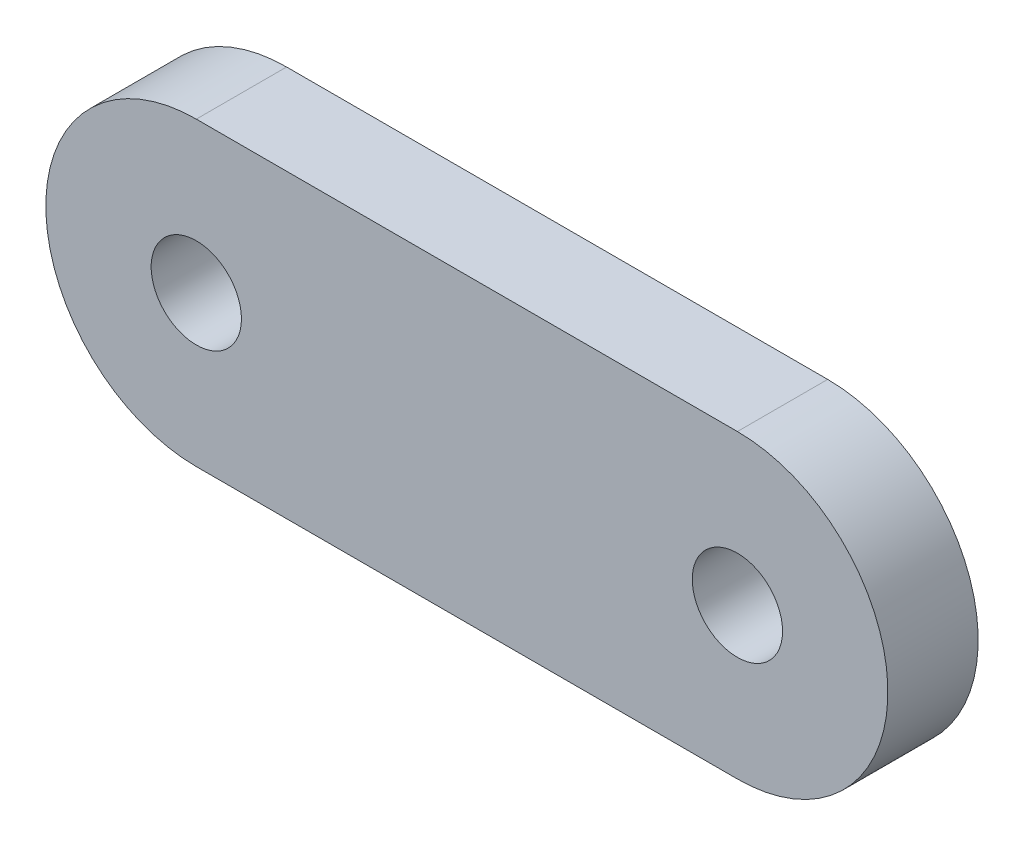
ISO-10303-21;
HEADER;
FILE_DESCRIPTION(('STEP AP214'),'2;1');
FILE_NAME('part.step','',(''),(''),'','','');
FILE_SCHEMA(('AUTOMOTIVE_DESIGN { 1 0 10303 214 1 1 1 1 }'));
ENDSEC;
DATA;
#1=APPLICATION_CONTEXT('core data for automotive mechanical design processes');
#2=APPLICATION_PROTOCOL_DEFINITION('international standard','automotive_design',2000,#1);
#3=PRODUCT_CONTEXT('',#1,'mechanical');
#4=PRODUCT('Part','Part','',(#3));
#5=PRODUCT_RELATED_PRODUCT_CATEGORY('part','',(#4));
#6=PRODUCT_DEFINITION_FORMATION('','',#4);
#7=PRODUCT_DEFINITION_CONTEXT('part definition',#1,'design');
#8=PRODUCT_DEFINITION('design','',#6,#7);
#9=PRODUCT_DEFINITION_SHAPE('','',#8);
#10=(LENGTH_UNIT() NAMED_UNIT(*) SI_UNIT(.MILLI.,.METRE.));
#11=(NAMED_UNIT(*) PLANE_ANGLE_UNIT() SI_UNIT($,.RADIAN.));
#12=(NAMED_UNIT(*) SI_UNIT($,.STERADIAN.) SOLID_ANGLE_UNIT());
#13=UNCERTAINTY_MEASURE_WITH_UNIT(LENGTH_MEASURE(1.E-05),#10,'distance_accuracy_value','');
#14=(GEOMETRIC_REPRESENTATION_CONTEXT(3) GLOBAL_UNCERTAINTY_ASSIGNED_CONTEXT((#13)) GLOBAL_UNIT_ASSIGNED_CONTEXT((#10,
#11,#12)) REPRESENTATION_CONTEXT('',''));
#15=CARTESIAN_POINT('',(0.,0.,0.));
#16=DIRECTION('',(0.,0.,1.));
#17=DIRECTION('',(1.,0.,0.));
#18=AXIS2_PLACEMENT_3D('',#15,#16,#17);
#19=CARTESIAN_POINT('',(-4.495,0.,0.75));
#20=DIRECTION('',(0.,0.,1.));
#21=DIRECTION('',(1.,0.,0.));
#22=AXIS2_PLACEMENT_3D('',#19,#20,#21);
#23=PLANE('',#22);
#24=CARTESIAN_POINT('',(4.495,0.,0.75));
#25=DIRECTION('',(0.,0.,1.));
#26=DIRECTION('',(1.,0.,0.));
#27=AXIS2_PLACEMENT_3D('',#24,#25,#26);
#28=CIRCLE('',#27,0.749999999999999);
#29=CARTESIAN_POINT('',(5.245,0.,0.75));
#30=VERTEX_POINT('',#29);
#31=EDGE_CURVE('E100',#30,#30,#28,.T.);
#32=ORIENTED_EDGE('',*,*,#31,.F.);
#33=EDGE_LOOP('',(#32));
#34=FACE_BOUND('',#33,.T.);
#35=CARTESIAN_POINT('',(-4.495,0.,0.75));
#36=DIRECTION('',(0.,0.,1.));
#37=DIRECTION('',(1.,0.,0.));
#38=AXIS2_PLACEMENT_3D('',#35,#36,#37);
#39=CIRCLE('',#38,2.5);
#40=CARTESIAN_POINT('',(-4.495,2.5,0.75));
#41=VERTEX_POINT('',#40);
#42=CARTESIAN_POINT('',(-4.495,-2.5,0.75));
#43=VERTEX_POINT('',#42);
#44=EDGE_CURVE('E85',#41,#43,#39,.T.);
#45=ORIENTED_EDGE('',*,*,#44,.T.);
#46=DIRECTION('',(1.,0.,0.));
#47=VECTOR('',#46,1.);
#48=CARTESIAN_POINT('',(-4.495,-2.5,0.75));
#49=LINE('',#48,#47);
#50=CARTESIAN_POINT('',(4.495,-2.5,0.75));
#51=VERTEX_POINT('',#50);
#52=EDGE_CURVE('E80',#43,#51,#49,.T.);
#53=ORIENTED_EDGE('',*,*,#52,.T.);
#54=CARTESIAN_POINT('',(4.495,0.,0.75));
#55=DIRECTION('',(0.,0.,1.));
#56=DIRECTION('',(1.,0.,0.));
#57=AXIS2_PLACEMENT_3D('',#54,#55,#56);
#58=CIRCLE('',#57,2.5);
#59=CARTESIAN_POINT('',(4.495,2.5,0.75));
#60=VERTEX_POINT('',#59);
#61=EDGE_CURVE('E83',#51,#60,#58,.T.);
#62=ORIENTED_EDGE('',*,*,#61,.T.);
#63=DIRECTION('',(-1.,0.,0.));
#64=VECTOR('',#63,1.);
#65=CARTESIAN_POINT('',(-4.495,2.5,0.75));
#66=LINE('',#65,#64);
#67=EDGE_CURVE('E50',#60,#41,#66,.T.);
#68=ORIENTED_EDGE('',*,*,#67,.T.);
#69=EDGE_LOOP('',(#45,#53,#62,#68));
#70=FACE_BOUND('',#69,.T.);
#71=CARTESIAN_POINT('',(-4.495,0.,0.75));
#72=DIRECTION('',(0.,0.,1.));
#73=DIRECTION('',(1.,0.,0.));
#74=AXIS2_PLACEMENT_3D('',#71,#72,#73);
#75=CIRCLE('',#74,0.75);
#76=CARTESIAN_POINT('',(-3.745,0.,0.75));
#77=VERTEX_POINT('',#76);
#78=EDGE_CURVE('E115',#77,#77,#75,.T.);
#79=ORIENTED_EDGE('',*,*,#78,.F.);
#80=EDGE_LOOP('',(#79));
#81=FACE_BOUND('',#80,.T.);
#82=ADVANCED_FACE('F33',(#34,#70,#81),#23,.T.);
#83=CARTESIAN_POINT('',(-4.495,0.,-0.75));
#84=DIRECTION('',(0.,0.,1.));
#85=DIRECTION('',(1.,0.,0.));
#86=AXIS2_PLACEMENT_3D('',#83,#84,#85);
#87=PLANE('',#86);
#88=CARTESIAN_POINT('',(-4.495,0.,-0.75));
#89=DIRECTION('',(0.,0.,1.));
#90=DIRECTION('',(1.,0.,0.));
#91=AXIS2_PLACEMENT_3D('',#88,#89,#90);
#92=CIRCLE('',#91,2.5);
#93=CARTESIAN_POINT('',(-4.495,2.5,-0.75));
#94=VERTEX_POINT('',#93);
#95=CARTESIAN_POINT('',(-4.495,-2.5,-0.75));
#96=VERTEX_POINT('',#95);
#97=EDGE_CURVE('E97',#94,#96,#92,.T.);
#98=ORIENTED_EDGE('',*,*,#97,.F.);
#99=DIRECTION('',(-1.,0.,0.));
#100=VECTOR('',#99,1.);
#101=CARTESIAN_POINT('',(-4.495,2.5,-0.75));
#102=LINE('',#101,#100);
#103=CARTESIAN_POINT('',(4.495,2.5,-0.75));
#104=VERTEX_POINT('',#103);
#105=EDGE_CURVE('E73',#104,#94,#102,.T.);
#106=ORIENTED_EDGE('',*,*,#105,.F.);
#107=CARTESIAN_POINT('',(4.495,0.,-0.75));
#108=DIRECTION('',(0.,0.,1.));
#109=DIRECTION('',(1.,0.,0.));
#110=AXIS2_PLACEMENT_3D('',#107,#108,#109);
#111=CIRCLE('',#110,2.5);
#112=CARTESIAN_POINT('',(4.495,-2.5,-0.75));
#113=VERTEX_POINT('',#112);
#114=EDGE_CURVE('E67',#113,#104,#111,.T.);
#115=ORIENTED_EDGE('',*,*,#114,.F.);
#116=DIRECTION('',(1.,0.,0.));
#117=VECTOR('',#116,1.);
#118=CARTESIAN_POINT('',(-4.495,-2.5,-0.75));
#119=LINE('',#118,#117);
#120=EDGE_CURVE('E89',#96,#113,#119,.T.);
#121=ORIENTED_EDGE('',*,*,#120,.F.);
#122=EDGE_LOOP('',(#98,#106,#115,#121));
#123=FACE_BOUND('',#122,.T.);
#124=CARTESIAN_POINT('',(4.495,0.,-0.75));
#125=DIRECTION('',(0.,0.,1.));
#126=DIRECTION('',(1.,0.,0.));
#127=AXIS2_PLACEMENT_3D('',#124,#125,#126);
#128=CIRCLE('',#127,0.749999999999999);
#129=CARTESIAN_POINT('',(5.245,0.,-0.75));
#130=VERTEX_POINT('',#129);
#131=EDGE_CURVE('E112',#130,#130,#128,.T.);
#132=ORIENTED_EDGE('',*,*,#131,.T.);
#133=EDGE_LOOP('',(#132));
#134=FACE_BOUND('',#133,.T.);
#135=CARTESIAN_POINT('',(-4.495,0.,-0.75));
#136=DIRECTION('',(0.,0.,1.));
#137=DIRECTION('',(1.,0.,0.));
#138=AXIS2_PLACEMENT_3D('',#135,#136,#137);
#139=CIRCLE('',#138,0.75);
#140=CARTESIAN_POINT('',(-3.745,0.,-0.75));
#141=VERTEX_POINT('',#140);
#142=EDGE_CURVE('E118',#141,#141,#139,.T.);
#143=ORIENTED_EDGE('',*,*,#142,.T.);
#144=EDGE_LOOP('',(#143));
#145=FACE_BOUND('',#144,.T.);
#146=ADVANCED_FACE('F108',(#123,#134,#145),#87,.F.);
#147=CARTESIAN_POINT('',(-4.495,0.,0.75));
#148=DIRECTION('',(0.,0.,-1.));
#149=DIRECTION('',(-1.,0.,0.));
#150=AXIS2_PLACEMENT_3D('',#147,#148,#149);
#151=CYLINDRICAL_SURFACE('',#150,2.5);
#152=ORIENTED_EDGE('',*,*,#97,.T.);
#153=DIRECTION('',(0.,0.,-1.));
#154=VECTOR('',#153,1.);
#155=CARTESIAN_POINT('',(-4.495,-2.5,0.75));
#156=LINE('',#155,#154);
#157=EDGE_CURVE('E11',#43,#96,#156,.T.);
#158=ORIENTED_EDGE('',*,*,#157,.F.);
#159=ORIENTED_EDGE('',*,*,#44,.F.);
#160=DIRECTION('',(0.,0.,-1.));
#161=VECTOR('',#160,1.);
#162=CARTESIAN_POINT('',(-4.495,2.5,0.75));
#163=LINE('',#162,#161);
#164=EDGE_CURVE('E93',#41,#94,#163,.T.);
#165=ORIENTED_EDGE('',*,*,#164,.T.);
#166=EDGE_LOOP('',(#152,#158,#159,#165));
#167=FACE_BOUND('',#166,.T.);
#168=ADVANCED_FACE('F35',(#167),#151,.T.);
#169=CARTESIAN_POINT('',(-4.495,-2.5,0.75));
#170=DIRECTION('',(0.,1.,0.));
#171=DIRECTION('',(-1.,0.,0.));
#172=AXIS2_PLACEMENT_3D('',#169,#170,#171);
#173=PLANE('',#172);
#174=ORIENTED_EDGE('',*,*,#120,.T.);
#175=DIRECTION('',(0.,0.,-1.));
#176=VECTOR('',#175,1.);
#177=CARTESIAN_POINT('',(4.495,-2.5,0.75));
#178=LINE('',#177,#176);
#179=EDGE_CURVE('E42',#51,#113,#178,.T.);
#180=ORIENTED_EDGE('',*,*,#179,.F.);
#181=ORIENTED_EDGE('',*,*,#52,.F.);
#182=ORIENTED_EDGE('',*,*,#157,.T.);
#183=EDGE_LOOP('',(#174,#180,#181,#182));
#184=FACE_BOUND('',#183,.T.);
#185=ADVANCED_FACE('F88',(#184),#173,.F.);
#186=CARTESIAN_POINT('',(4.495,0.,0.75));
#187=DIRECTION('',(0.,0.,-1.));
#188=DIRECTION('',(-1.,0.,0.));
#189=AXIS2_PLACEMENT_3D('',#186,#187,#188);
#190=CYLINDRICAL_SURFACE('',#189,2.5);
#191=ORIENTED_EDGE('',*,*,#114,.T.);
#192=DIRECTION('',(0.,0.,-1.));
#193=VECTOR('',#192,1.);
#194=CARTESIAN_POINT('',(4.495,2.5,0.75));
#195=LINE('',#194,#193);
#196=EDGE_CURVE('E90',#60,#104,#195,.T.);
#197=ORIENTED_EDGE('',*,*,#196,.F.);
#198=ORIENTED_EDGE('',*,*,#61,.F.);
#199=ORIENTED_EDGE('',*,*,#179,.T.);
#200=EDGE_LOOP('',(#191,#197,#198,#199));
#201=FACE_BOUND('',#200,.T.);
#202=ADVANCED_FACE('F91',(#201),#190,.T.);
#203=CARTESIAN_POINT('',(-4.495,2.5,0.75));
#204=DIRECTION('',(0.,-1.,0.));
#205=DIRECTION('',(1.,0.,0.));
#206=AXIS2_PLACEMENT_3D('',#203,#204,#205);
#207=PLANE('',#206);
#208=ORIENTED_EDGE('',*,*,#105,.T.);
#209=ORIENTED_EDGE('',*,*,#164,.F.);
#210=ORIENTED_EDGE('',*,*,#67,.F.);
#211=ORIENTED_EDGE('',*,*,#196,.T.);
#212=EDGE_LOOP('',(#208,#209,#210,#211));
#213=FACE_BOUND('',#212,.T.);
#214=ADVANCED_FACE('F105',(#213),#207,.F.);
#215=CARTESIAN_POINT('',(4.495,0.,0.75));
#216=DIRECTION('',(0.,0.,-1.));
#217=DIRECTION('',(-1.,0.,0.));
#218=AXIS2_PLACEMENT_3D('',#215,#216,#217);
#219=CYLINDRICAL_SURFACE('',#218,0.749999999999999);
#220=ORIENTED_EDGE('',*,*,#31,.T.);
#221=EDGE_LOOP('',(#220));
#222=FACE_BOUND('',#221,.T.);
#223=ORIENTED_EDGE('',*,*,#131,.F.);
#224=EDGE_LOOP('',(#223));
#225=FACE_BOUND('',#224,.T.);
#226=ADVANCED_FACE('F135',(#222,#225),#219,.F.);
#227=CARTESIAN_POINT('',(-4.495,0.,0.75));
#228=DIRECTION('',(0.,0.,-1.));
#229=DIRECTION('',(-1.,0.,0.));
#230=AXIS2_PLACEMENT_3D('',#227,#228,#229);
#231=CYLINDRICAL_SURFACE('',#230,0.75);
#232=ORIENTED_EDGE('',*,*,#78,.T.);
#233=EDGE_LOOP('',(#232));
#234=FACE_BOUND('',#233,.T.);
#235=ORIENTED_EDGE('',*,*,#142,.F.);
#236=EDGE_LOOP('',(#235));
#237=FACE_BOUND('',#236,.T.);
#238=ADVANCED_FACE('F124',(#234,#237),#231,.F.);
#239=CLOSED_SHELL('',(#82,#146,#168,#185,#202,#214,#226,#238));
#240=MANIFOLD_SOLID_BREP('B2',#239);
#241=ADVANCED_BREP_SHAPE_REPRESENTATION('',(#18,#240),#14);
#242=SHAPE_DEFINITION_REPRESENTATION(#9,#241);
ENDSEC;
END-ISO-10303-21;
